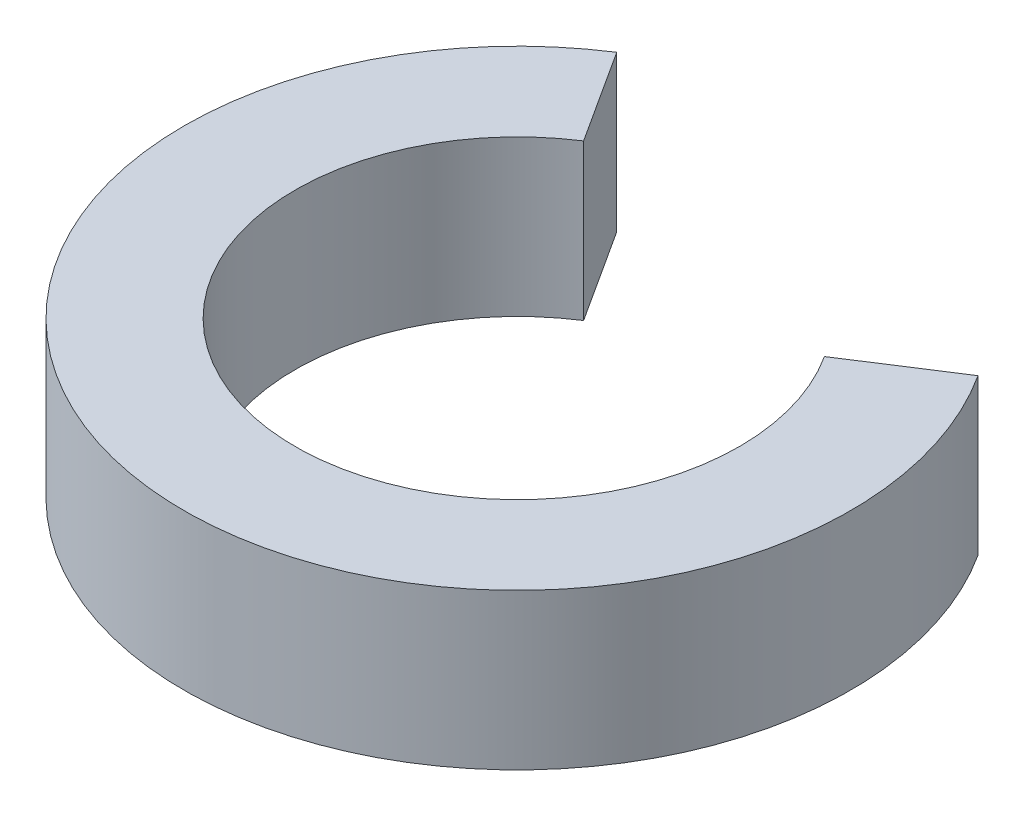
ISO-10303-21;
HEADER;
FILE_DESCRIPTION(('STEP AP214'),'2;1');
FILE_NAME('part.step','',(''),(''),'','','');
FILE_SCHEMA(('AUTOMOTIVE_DESIGN { 1 0 10303 214 1 1 1 1 }'));
ENDSEC;
DATA;
#1=APPLICATION_CONTEXT('core data for automotive mechanical design processes');
#2=APPLICATION_PROTOCOL_DEFINITION('international standard','automotive_design',2000,#1);
#3=PRODUCT_CONTEXT('',#1,'mechanical');
#4=PRODUCT('Part','Part','',(#3));
#5=PRODUCT_RELATED_PRODUCT_CATEGORY('part','',(#4));
#6=PRODUCT_DEFINITION_FORMATION('','',#4);
#7=PRODUCT_DEFINITION_CONTEXT('part definition',#1,'design');
#8=PRODUCT_DEFINITION('design','',#6,#7);
#9=PRODUCT_DEFINITION_SHAPE('','',#8);
#10=(LENGTH_UNIT() NAMED_UNIT(*) SI_UNIT(.MILLI.,.METRE.));
#11=(NAMED_UNIT(*) PLANE_ANGLE_UNIT() SI_UNIT($,.RADIAN.));
#12=(NAMED_UNIT(*) SI_UNIT($,.STERADIAN.) SOLID_ANGLE_UNIT());
#13=UNCERTAINTY_MEASURE_WITH_UNIT(LENGTH_MEASURE(1.E-05),#10,'distance_accuracy_value','');
#14=(GEOMETRIC_REPRESENTATION_CONTEXT(3) GLOBAL_UNCERTAINTY_ASSIGNED_CONTEXT((#13)) GLOBAL_UNIT_ASSIGNED_CONTEXT((#10,
#11,#12)) REPRESENTATION_CONTEXT('',''));
#15=CARTESIAN_POINT('',(0.,0.,0.));
#16=DIRECTION('',(0.,0.,1.));
#17=DIRECTION('',(1.,0.,0.));
#18=AXIS2_PLACEMENT_3D('',#15,#16,#17);
#19=CARTESIAN_POINT('',(0.,7.,0.));
#20=DIRECTION('',(0.,-1.,0.));
#21=DIRECTION('',(0.,0.,-1.));
#22=AXIS2_PLACEMENT_3D('',#19,#20,#21);
#23=CYLINDRICAL_SURFACE('',#22,10.);
#24=CARTESIAN_POINT('',(0.,0.,0.));
#25=DIRECTION('',(0.,-1.,0.));
#26=DIRECTION('',(0.,0.,-1.));
#27=AXIS2_PLACEMENT_3D('',#24,#25,#26);
#28=CIRCLE('',#27,10.);
#29=CARTESIAN_POINT('',(8.40386126188613,0.,-5.41988153846278));
#30=VERTEX_POINT('',#29);
#31=CARTESIAN_POINT('',(-5.41988153846278,0.,-8.40386126188613));
#32=VERTEX_POINT('',#31);
#33=EDGE_CURVE('E113',#30,#32,#28,.T.);
#34=ORIENTED_EDGE('',*,*,#33,.T.);
#35=DIRECTION('',(0.,-1.,0.));
#36=VECTOR('',#35,1.);
#37=CARTESIAN_POINT('',(-5.41988153846278,7.,-8.40386126188613));
#38=LINE('',#37,#36);
#39=CARTESIAN_POINT('',(-5.41988153846278,7.,-8.40386126188613));
#40=VERTEX_POINT('',#39);
#41=EDGE_CURVE('E11',#40,#32,#38,.T.);
#42=ORIENTED_EDGE('',*,*,#41,.F.);
#43=CARTESIAN_POINT('',(0.,7.,0.));
#44=DIRECTION('',(0.,-1.,0.));
#45=DIRECTION('',(0.,0.,-1.));
#46=AXIS2_PLACEMENT_3D('',#43,#44,#45);
#47=CIRCLE('',#46,10.);
#48=CARTESIAN_POINT('',(8.40386126188613,7.,-5.41988153846278));
#49=VERTEX_POINT('',#48);
#50=EDGE_CURVE('E97',#49,#40,#47,.T.);
#51=ORIENTED_EDGE('',*,*,#50,.F.);
#52=DIRECTION('',(0.,-1.,0.));
#53=VECTOR('',#52,1.);
#54=CARTESIAN_POINT('',(8.40386126188613,7.,-5.41988153846278));
#55=LINE('',#54,#53);
#56=EDGE_CURVE('E109',#49,#30,#55,.T.);
#57=ORIENTED_EDGE('',*,*,#56,.T.);
#58=EDGE_LOOP('',(#34,#42,#51,#57));
#59=FACE_BOUND('',#58,.T.);
#60=ADVANCED_FACE('F45',(#59),#23,.F.);
#61=CARTESIAN_POINT('',(-5.41988153846278,7.,-8.40386126188613));
#62=DIRECTION('',(-0.840386126188612,0.,0.541988153846279));
#63=DIRECTION('',(0.541988153846279,0.,0.840386126188612));
#64=AXIS2_PLACEMENT_3D('',#61,#62,#63);
#65=PLANE('',#64);
#66=DIRECTION('',(-0.541988153846279,0.,-0.840386126188612));
#67=VECTOR('',#66,1.);
#68=CARTESIAN_POINT('',(-5.41988153846278,0.,-8.40386126188613));
#69=LINE('',#68,#67);
#70=CARTESIAN_POINT('',(-8.12982230769417,0.,-12.6057918928292));
#71=VERTEX_POINT('',#70);
#72=EDGE_CURVE('E102',#32,#71,#69,.T.);
#73=ORIENTED_EDGE('',*,*,#72,.T.);
#74=DIRECTION('',(0.,-1.,0.));
#75=VECTOR('',#74,1.);
#76=CARTESIAN_POINT('',(-8.12982230769417,7.,-12.6057918928292));
#77=LINE('',#76,#75);
#78=CARTESIAN_POINT('',(-8.12982230769417,7.,-12.6057918928292));
#79=VERTEX_POINT('',#78);
#80=EDGE_CURVE('E54',#79,#71,#77,.T.);
#81=ORIENTED_EDGE('',*,*,#80,.F.);
#82=DIRECTION('',(-0.541988153846279,0.,-0.840386126188612));
#83=VECTOR('',#82,1.);
#84=CARTESIAN_POINT('',(-5.41988153846278,7.,-8.40386126188613));
#85=LINE('',#84,#83);
#86=EDGE_CURVE('E92',#40,#79,#85,.T.);
#87=ORIENTED_EDGE('',*,*,#86,.F.);
#88=ORIENTED_EDGE('',*,*,#41,.T.);
#89=EDGE_LOOP('',(#73,#81,#87,#88));
#90=FACE_BOUND('',#89,.T.);
#91=ADVANCED_FACE('F101',(#90),#65,.F.);
#92=CARTESIAN_POINT('',(0.,7.,0.));
#93=DIRECTION('',(0.,-1.,0.));
#94=DIRECTION('',(0.,0.,-1.));
#95=AXIS2_PLACEMENT_3D('',#92,#93,#94);
#96=CYLINDRICAL_SURFACE('',#95,15.);
#97=CARTESIAN_POINT('',(0.,0.,0.));
#98=DIRECTION('',(0.,1.,0.));
#99=DIRECTION('',(0.,0.,1.));
#100=AXIS2_PLACEMENT_3D('',#97,#98,#99);
#101=CIRCLE('',#100,15.);
#102=CARTESIAN_POINT('',(12.6057918928292,0.,-8.12982230769418));
#103=VERTEX_POINT('',#102);
#104=EDGE_CURVE('E79',#71,#103,#101,.T.);
#105=ORIENTED_EDGE('',*,*,#104,.T.);
#106=DIRECTION('',(0.,-1.,0.));
#107=VECTOR('',#106,1.);
#108=CARTESIAN_POINT('',(12.6057918928292,7.,-8.12982230769418));
#109=LINE('',#108,#107);
#110=CARTESIAN_POINT('',(12.6057918928292,7.,-8.12982230769418));
#111=VERTEX_POINT('',#110);
#112=EDGE_CURVE('E104',#111,#103,#109,.T.);
#113=ORIENTED_EDGE('',*,*,#112,.F.);
#114=CARTESIAN_POINT('',(0.,7.,0.));
#115=DIRECTION('',(0.,1.,0.));
#116=DIRECTION('',(0.,0.,1.));
#117=AXIS2_PLACEMENT_3D('',#114,#115,#116);
#118=CIRCLE('',#117,15.);
#119=EDGE_CURVE('E95',#79,#111,#118,.T.);
#120=ORIENTED_EDGE('',*,*,#119,.F.);
#121=ORIENTED_EDGE('',*,*,#80,.T.);
#122=EDGE_LOOP('',(#105,#113,#120,#121));
#123=FACE_BOUND('',#122,.T.);
#124=ADVANCED_FACE('F105',(#123),#96,.T.);
#125=CARTESIAN_POINT('',(8.40386126188613,7.,-5.41988153846278));
#126=DIRECTION('',(0.541988153846279,0.,0.840386126188612));
#127=DIRECTION('',(0.840386126188612,0.,-0.541988153846279));
#128=AXIS2_PLACEMENT_3D('',#125,#126,#127);
#129=PLANE('',#128);
#130=DIRECTION('',(-0.840386126188612,0.,0.541988153846279));
#131=VECTOR('',#130,1.);
#132=CARTESIAN_POINT('',(8.40386126188613,0.,-5.41988153846278));
#133=LINE('',#132,#131);
#134=EDGE_CURVE('E85',#103,#30,#133,.T.);
#135=ORIENTED_EDGE('',*,*,#134,.T.);
#136=ORIENTED_EDGE('',*,*,#56,.F.);
#137=DIRECTION('',(-0.840386126188612,0.,0.541988153846279));
#138=VECTOR('',#137,1.);
#139=CARTESIAN_POINT('',(8.40386126188613,7.,-5.41988153846278));
#140=LINE('',#139,#138);
#141=EDGE_CURVE('E62',#111,#49,#140,.T.);
#142=ORIENTED_EDGE('',*,*,#141,.F.);
#143=ORIENTED_EDGE('',*,*,#112,.T.);
#144=EDGE_LOOP('',(#135,#136,#142,#143));
#145=FACE_BOUND('',#144,.T.);
#146=ADVANCED_FACE('F126',(#145),#129,.F.);
#147=CARTESIAN_POINT('',(0.,7.,0.));
#148=DIRECTION('',(0.,-1.,0.));
#149=DIRECTION('',(0.,0.,-1.));
#150=AXIS2_PLACEMENT_3D('',#147,#148,#149);
#151=PLANE('',#150);
#152=ORIENTED_EDGE('',*,*,#50,.T.);
#153=ORIENTED_EDGE('',*,*,#86,.T.);
#154=ORIENTED_EDGE('',*,*,#119,.T.);
#155=ORIENTED_EDGE('',*,*,#141,.T.);
#156=EDGE_LOOP('',(#152,#153,#154,#155));
#157=FACE_BOUND('',#156,.T.);
#158=ADVANCED_FACE('F93',(#157),#151,.F.);
#159=CARTESIAN_POINT('',(0.,0.,0.));
#160=DIRECTION('',(0.,-1.,0.));
#161=DIRECTION('',(0.,0.,-1.));
#162=AXIS2_PLACEMENT_3D('',#159,#160,#161);
#163=PLANE('',#162);
#164=ORIENTED_EDGE('',*,*,#33,.F.);
#165=ORIENTED_EDGE('',*,*,#134,.F.);
#166=ORIENTED_EDGE('',*,*,#104,.F.);
#167=ORIENTED_EDGE('',*,*,#72,.F.);
#168=EDGE_LOOP('',(#164,#165,#166,#167));
#169=FACE_BOUND('',#168,.T.);
#170=ADVANCED_FACE('F129',(#169),#163,.T.);
#171=CLOSED_SHELL('',(#60,#91,#124,#146,#158,#170));
#172=MANIFOLD_SOLID_BREP('B2',#171);
#173=ADVANCED_BREP_SHAPE_REPRESENTATION('',(#18,#172),#14);
#174=SHAPE_DEFINITION_REPRESENTATION(#9,#173);
ENDSEC;
END-ISO-10303-21;
